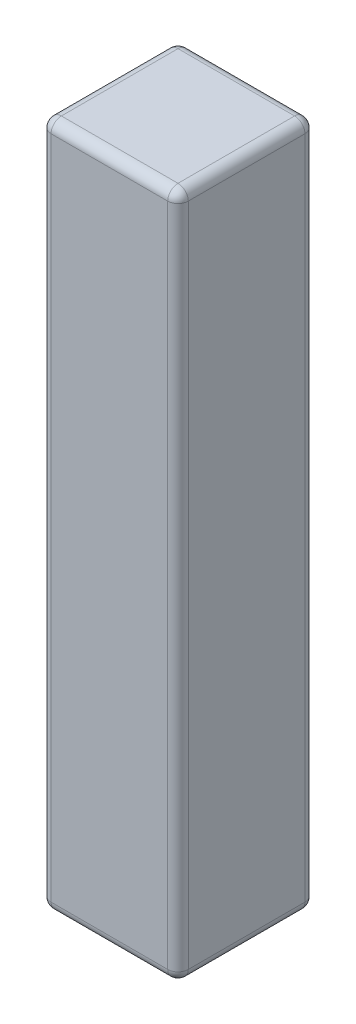
ISO-10303-21;
HEADER;
FILE_DESCRIPTION(('STEP AP214'),'2;1');
FILE_NAME('part.step','',(''),(''),'','','');
FILE_SCHEMA(('AUTOMOTIVE_DESIGN { 1 0 10303 214 1 1 1 1 }'));
ENDSEC;
DATA;
#1=APPLICATION_CONTEXT('core data for automotive mechanical design processes');
#2=APPLICATION_PROTOCOL_DEFINITION('international standard','automotive_design',2000,#1);
#3=PRODUCT_CONTEXT('',#1,'mechanical');
#4=PRODUCT('Part','Part','',(#3));
#5=PRODUCT_RELATED_PRODUCT_CATEGORY('part','',(#4));
#6=PRODUCT_DEFINITION_FORMATION('','',#4);
#7=PRODUCT_DEFINITION_CONTEXT('part definition',#1,'design');
#8=PRODUCT_DEFINITION('design','',#6,#7);
#9=PRODUCT_DEFINITION_SHAPE('','',#8);
#10=(LENGTH_UNIT() NAMED_UNIT(*) SI_UNIT(.MILLI.,.METRE.));
#11=(NAMED_UNIT(*) PLANE_ANGLE_UNIT() SI_UNIT($,.RADIAN.));
#12=(NAMED_UNIT(*) SI_UNIT($,.STERADIAN.) SOLID_ANGLE_UNIT());
#13=UNCERTAINTY_MEASURE_WITH_UNIT(LENGTH_MEASURE(1.E-05),#10,'distance_accuracy_value','');
#14=(GEOMETRIC_REPRESENTATION_CONTEXT(3) GLOBAL_UNCERTAINTY_ASSIGNED_CONTEXT((#13)) GLOBAL_UNIT_ASSIGNED_CONTEXT((#10,
#11,#12)) REPRESENTATION_CONTEXT('',''));
#15=CARTESIAN_POINT('',(0.,0.,0.));
#16=DIRECTION('',(0.,0.,1.));
#17=DIRECTION('',(1.,0.,0.));
#18=AXIS2_PLACEMENT_3D('',#15,#16,#17);
#19=CARTESIAN_POINT('',(-1.00000054,5.,-1.00000054));
#20=DIRECTION('',(1.,0.,0.));
#21=DIRECTION('',(0.,0.,-1.));
#22=AXIS2_PLACEMENT_3D('',#19,#20,#21);
#23=PLANE('',#22);
#24=DIRECTION('',(0.,-1.,0.));
#25=VECTOR('',#24,1.);
#26=CARTESIAN_POINT('',(-1.00000054,5.,0.85000054));
#27=LINE('',#26,#25);
#28=CARTESIAN_POINT('',(-1.00000054,-4.85,0.85000054));
#29=VERTEX_POINT('',#28);
#30=CARTESIAN_POINT('',(-1.00000054,4.85,0.85000054));
#31=VERTEX_POINT('',#30);
#32=EDGE_CURVE('E216',#29,#31,#27,.F.);
#33=ORIENTED_EDGE('',*,*,#32,.T.);
#34=DIRECTION('',(0.,0.,1.));
#35=VECTOR('',#34,1.);
#36=CARTESIAN_POINT('',(-1.00000054,4.85,-1.00000054));
#37=LINE('',#36,#35);
#38=CARTESIAN_POINT('',(-1.00000054,4.85,-0.85000054));
#39=VERTEX_POINT('',#38);
#40=EDGE_CURVE('E219',#31,#39,#37,.F.);
#41=ORIENTED_EDGE('',*,*,#40,.T.);
#42=DIRECTION('',(0.,-1.,0.));
#43=VECTOR('',#42,1.);
#44=CARTESIAN_POINT('',(-1.00000054,5.,-0.85000054));
#45=LINE('',#44,#43);
#46=CARTESIAN_POINT('',(-1.00000054,-4.85,-0.85000054));
#47=VERTEX_POINT('',#46);
#48=EDGE_CURVE('E217',#39,#47,#45,.T.);
#49=ORIENTED_EDGE('',*,*,#48,.T.);
#50=DIRECTION('',(0.,0.,1.));
#51=VECTOR('',#50,1.);
#52=CARTESIAN_POINT('',(-1.00000054,-4.85,-1.00000054));
#53=LINE('',#52,#51);
#54=EDGE_CURVE('E213',#47,#29,#53,.T.);
#55=ORIENTED_EDGE('',*,*,#54,.T.);
#56=EDGE_LOOP('',(#33,#41,#49,#55));
#57=FACE_BOUND('',#56,.T.);
#58=ADVANCED_FACE('F34',(#57),#23,.F.);
#59=CARTESIAN_POINT('',(-1.00000054,5.,1.00000054));
#60=DIRECTION('',(0.,0.,-1.));
#61=DIRECTION('',(-1.,0.,0.));
#62=AXIS2_PLACEMENT_3D('',#59,#60,#61);
#63=PLANE('',#62);
#64=DIRECTION('',(1.,0.,0.));
#65=VECTOR('',#64,1.);
#66=CARTESIAN_POINT('',(-1.00000054,-4.85,1.00000054));
#67=LINE('',#66,#65);
#68=CARTESIAN_POINT('',(-0.85000054,-4.85,1.00000054));
#69=VERTEX_POINT('',#68);
#70=CARTESIAN_POINT('',(0.85000054,-4.85,1.00000054));
#71=VERTEX_POINT('',#70);
#72=EDGE_CURVE('E257',#69,#71,#67,.T.);
#73=ORIENTED_EDGE('',*,*,#72,.T.);
#74=DIRECTION('',(0.,-1.,0.));
#75=VECTOR('',#74,1.);
#76=CARTESIAN_POINT('',(0.85000054,5.,1.00000054));
#77=LINE('',#76,#75);
#78=CARTESIAN_POINT('',(0.85000054,4.85,1.00000054));
#79=VERTEX_POINT('',#78);
#80=EDGE_CURVE('E263',#71,#79,#77,.F.);
#81=ORIENTED_EDGE('',*,*,#80,.T.);
#82=DIRECTION('',(1.,0.,0.));
#83=VECTOR('',#82,1.);
#84=CARTESIAN_POINT('',(-1.00000054,4.85,1.00000054));
#85=LINE('',#84,#83);
#86=CARTESIAN_POINT('',(-0.85000054,4.85,1.00000054));
#87=VERTEX_POINT('',#86);
#88=EDGE_CURVE('E260',#79,#87,#85,.F.);
#89=ORIENTED_EDGE('',*,*,#88,.T.);
#90=DIRECTION('',(0.,-1.,0.));
#91=VECTOR('',#90,1.);
#92=CARTESIAN_POINT('',(-0.85000054,5.,1.00000054));
#93=LINE('',#92,#91);
#94=EDGE_CURVE('E252',#87,#69,#93,.T.);
#95=ORIENTED_EDGE('',*,*,#94,.T.);
#96=EDGE_LOOP('',(#73,#81,#89,#95));
#97=FACE_BOUND('',#96,.T.);
#98=ADVANCED_FACE('F261',(#97),#63,.F.);
#99=CARTESIAN_POINT('',(1.00000054,5.,-1.00000054));
#100=DIRECTION('',(-1.,0.,0.));
#101=DIRECTION('',(0.,0.,1.));
#102=AXIS2_PLACEMENT_3D('',#99,#100,#101);
#103=PLANE('',#102);
#104=DIRECTION('',(0.,0.,-1.));
#105=VECTOR('',#104,1.);
#106=CARTESIAN_POINT('',(1.00000054,4.85,1.00000054));
#107=LINE('',#106,#105);
#108=CARTESIAN_POINT('',(1.00000054,4.85,-0.85000054));
#109=VERTEX_POINT('',#108);
#110=CARTESIAN_POINT('',(1.00000054,4.85,0.85000054));
#111=VERTEX_POINT('',#110);
#112=EDGE_CURVE('E153',#109,#111,#107,.F.);
#113=ORIENTED_EDGE('',*,*,#112,.T.);
#114=DIRECTION('',(0.,-1.,0.));
#115=VECTOR('',#114,1.);
#116=CARTESIAN_POINT('',(1.00000054,5.,0.85000054));
#117=LINE('',#116,#115);
#118=CARTESIAN_POINT('',(1.00000054,-4.85,0.85000054));
#119=VERTEX_POINT('',#118);
#120=EDGE_CURVE('E221',#111,#119,#117,.T.);
#121=ORIENTED_EDGE('',*,*,#120,.T.);
#122=DIRECTION('',(0.,0.,-1.));
#123=VECTOR('',#122,1.);
#124=CARTESIAN_POINT('',(1.00000054,-4.85,-1.00000054));
#125=LINE('',#124,#123);
#126=CARTESIAN_POINT('',(1.00000054,-4.85,-0.85000054));
#127=VERTEX_POINT('',#126);
#128=EDGE_CURVE('E280',#119,#127,#125,.T.);
#129=ORIENTED_EDGE('',*,*,#128,.T.);
#130=DIRECTION('',(0.,-1.,0.));
#131=VECTOR('',#130,1.);
#132=CARTESIAN_POINT('',(1.00000054,5.,-0.85000054));
#133=LINE('',#132,#131);
#134=EDGE_CURVE('E278',#127,#109,#133,.F.);
#135=ORIENTED_EDGE('',*,*,#134,.T.);
#136=EDGE_LOOP('',(#113,#121,#129,#135));
#137=FACE_BOUND('',#136,.T.);
#138=ADVANCED_FACE('F285',(#137),#103,.F.);
#139=CARTESIAN_POINT('',(-1.00000054,5.,-1.00000054));
#140=DIRECTION('',(0.,0.,1.));
#141=DIRECTION('',(1.,0.,0.));
#142=AXIS2_PLACEMENT_3D('',#139,#140,#141);
#143=PLANE('',#142);
#144=DIRECTION('',(-1.,0.,0.));
#145=VECTOR('',#144,1.);
#146=CARTESIAN_POINT('',(1.00000054,4.85,-1.00000054));
#147=LINE('',#146,#145);
#148=CARTESIAN_POINT('',(-0.85000054,4.85,-1.00000054));
#149=VERTEX_POINT('',#148);
#150=CARTESIAN_POINT('',(0.85000054,4.85,-1.00000054));
#151=VERTEX_POINT('',#150);
#152=EDGE_CURVE('E43',#149,#151,#147,.F.);
#153=ORIENTED_EDGE('',*,*,#152,.T.);
#154=DIRECTION('',(0.,-1.,0.));
#155=VECTOR('',#154,1.);
#156=CARTESIAN_POINT('',(0.85000054,5.,-1.00000054));
#157=LINE('',#156,#155);
#158=CARTESIAN_POINT('',(0.85000054,-4.85,-1.00000054));
#159=VERTEX_POINT('',#158);
#160=EDGE_CURVE('E11',#151,#159,#157,.T.);
#161=ORIENTED_EDGE('',*,*,#160,.T.);
#162=DIRECTION('',(-1.,0.,0.));
#163=VECTOR('',#162,1.);
#164=CARTESIAN_POINT('',(-1.00000054,-4.85,-1.00000054));
#165=LINE('',#164,#163);
#166=CARTESIAN_POINT('',(-0.85000054,-4.85,-1.00000054));
#167=VERTEX_POINT('',#166);
#168=EDGE_CURVE('E227',#159,#167,#165,.T.);
#169=ORIENTED_EDGE('',*,*,#168,.T.);
#170=DIRECTION('',(0.,-1.,0.));
#171=VECTOR('',#170,1.);
#172=CARTESIAN_POINT('',(-0.85000054,5.,-1.00000054));
#173=LINE('',#172,#171);
#174=EDGE_CURVE('E54',#167,#149,#173,.F.);
#175=ORIENTED_EDGE('',*,*,#174,.T.);
#176=EDGE_LOOP('',(#153,#161,#169,#175));
#177=FACE_BOUND('',#176,.T.);
#178=ADVANCED_FACE('F356',(#177),#143,.F.);
#179=CARTESIAN_POINT('',(-1.00000054,5.,1.00000054));
#180=DIRECTION('',(0.,1.,0.));
#181=DIRECTION('',(0.,0.,1.));
#182=AXIS2_PLACEMENT_3D('',#179,#180,#181);
#183=PLANE('',#182);
#184=DIRECTION('',(0.,0.,1.));
#185=VECTOR('',#184,1.);
#186=CARTESIAN_POINT('',(-0.85000054,5.,1.00000054));
#187=LINE('',#186,#185);
#188=CARTESIAN_POINT('',(-0.85000054,5.,-0.85000054));
#189=VERTEX_POINT('',#188);
#190=CARTESIAN_POINT('',(-0.85000054,5.,0.85000054));
#191=VERTEX_POINT('',#190);
#192=EDGE_CURVE('E132',#189,#191,#187,.T.);
#193=ORIENTED_EDGE('',*,*,#192,.T.);
#194=DIRECTION('',(1.,0.,0.));
#195=VECTOR('',#194,1.);
#196=CARTESIAN_POINT('',(1.00000054,5.,0.85000054));
#197=LINE('',#196,#195);
#198=CARTESIAN_POINT('',(0.85000054,5.,0.85000054));
#199=VERTEX_POINT('',#198);
#200=EDGE_CURVE('E128',#191,#199,#197,.T.);
#201=ORIENTED_EDGE('',*,*,#200,.T.);
#202=DIRECTION('',(0.,0.,-1.));
#203=VECTOR('',#202,1.);
#204=CARTESIAN_POINT('',(0.85000054,5.,-1.00000054));
#205=LINE('',#204,#203);
#206=CARTESIAN_POINT('',(0.85000054,5.,-0.85000054));
#207=VERTEX_POINT('',#206);
#208=EDGE_CURVE('E122',#199,#207,#205,.T.);
#209=ORIENTED_EDGE('',*,*,#208,.T.);
#210=DIRECTION('',(-1.,0.,0.));
#211=VECTOR('',#210,1.);
#212=CARTESIAN_POINT('',(-1.00000054,5.,-0.85000054));
#213=LINE('',#212,#211);
#214=EDGE_CURVE('E125',#207,#189,#213,.T.);
#215=ORIENTED_EDGE('',*,*,#214,.T.);
#216=EDGE_LOOP('',(#193,#201,#209,#215));
#217=FACE_BOUND('',#216,.T.);
#218=ADVANCED_FACE('F124',(#217),#183,.T.);
#219=CARTESIAN_POINT('',(-1.00000054,-5.,1.00000054));
#220=DIRECTION('',(0.,1.,0.));
#221=DIRECTION('',(0.,0.,1.));
#222=AXIS2_PLACEMENT_3D('',#219,#220,#221);
#223=PLANE('',#222);
#224=DIRECTION('',(0.,0.,-1.));
#225=VECTOR('',#224,1.);
#226=CARTESIAN_POINT('',(0.85000054,-5.,1.00000054));
#227=LINE('',#226,#225);
#228=CARTESIAN_POINT('',(0.85000054,-5.,-0.85000054));
#229=VERTEX_POINT('',#228);
#230=CARTESIAN_POINT('',(0.85000054,-5.,0.85000054));
#231=VERTEX_POINT('',#230);
#232=EDGE_CURVE('E274',#229,#231,#227,.F.);
#233=ORIENTED_EDGE('',*,*,#232,.T.);
#234=DIRECTION('',(1.,0.,0.));
#235=VECTOR('',#234,1.);
#236=CARTESIAN_POINT('',(-1.00000054,-5.,0.85000054));
#237=LINE('',#236,#235);
#238=CARTESIAN_POINT('',(-0.85000054,-5.,0.85000054));
#239=VERTEX_POINT('',#238);
#240=EDGE_CURVE('E276',#231,#239,#237,.F.);
#241=ORIENTED_EDGE('',*,*,#240,.T.);
#242=DIRECTION('',(0.,0.,1.));
#243=VECTOR('',#242,1.);
#244=CARTESIAN_POINT('',(-0.85000054,-5.,1.00000054));
#245=LINE('',#244,#243);
#246=CARTESIAN_POINT('',(-0.85000054,-5.,-0.85000054));
#247=VERTEX_POINT('',#246);
#248=EDGE_CURVE('E211',#239,#247,#245,.F.);
#249=ORIENTED_EDGE('',*,*,#248,.T.);
#250=DIRECTION('',(-1.,0.,0.));
#251=VECTOR('',#250,1.);
#252=CARTESIAN_POINT('',(-1.00000054,-5.,-0.85000054));
#253=LINE('',#252,#251);
#254=EDGE_CURVE('E268',#247,#229,#253,.F.);
#255=ORIENTED_EDGE('',*,*,#254,.T.);
#256=EDGE_LOOP('',(#233,#241,#249,#255));
#257=FACE_BOUND('',#256,.T.);
#258=ADVANCED_FACE('F357',(#257),#223,.F.);
#259=CARTESIAN_POINT('',(-1.00000054,-4.85,-0.85000054));
#260=DIRECTION('',(-1.,0.,0.));
#261=DIRECTION('',(0.,0.,1.));
#262=AXIS2_PLACEMENT_3D('',#259,#260,#261);
#263=CYLINDRICAL_SURFACE('',#262,0.15);
#264=CARTESIAN_POINT('',(-0.85000054,-4.85,-0.85000054));
#265=DIRECTION('',(-1.,0.,0.));
#266=DIRECTION('',(0.,0.,1.));
#267=AXIS2_PLACEMENT_3D('',#264,#265,#266);
#268=CIRCLE('',#267,0.15);
#269=EDGE_CURVE('E38',#167,#247,#268,.T.);
#270=ORIENTED_EDGE('',*,*,#269,.F.);
#271=ORIENTED_EDGE('',*,*,#168,.F.);
#272=CARTESIAN_POINT('',(0.85000054,-4.85,-0.85000054));
#273=DIRECTION('',(1.,0.,0.));
#274=DIRECTION('',(0.,0.,-1.));
#275=AXIS2_PLACEMENT_3D('',#272,#273,#274);
#276=CIRCLE('',#275,0.15);
#277=EDGE_CURVE('E191',#229,#159,#276,.T.);
#278=ORIENTED_EDGE('',*,*,#277,.F.);
#279=ORIENTED_EDGE('',*,*,#254,.F.);
#280=EDGE_LOOP('',(#270,#271,#278,#279));
#281=FACE_BOUND('',#280,.T.);
#282=ADVANCED_FACE('F36',(#281),#263,.T.);
#283=CARTESIAN_POINT('',(-0.85000054,-4.85,-0.85000054));
#284=DIRECTION('',(0.,0.,1.));
#285=DIRECTION('',(1.,0.,0.));
#286=AXIS2_PLACEMENT_3D('',#283,#284,#285);
#287=SPHERICAL_SURFACE('',#286,0.15);
#288=CARTESIAN_POINT('',(-0.85000054,-4.85,-0.85000054));
#289=DIRECTION('',(0.,-1.,0.));
#290=DIRECTION('',(0.,0.,-1.));
#291=AXIS2_PLACEMENT_3D('',#288,#289,#290);
#292=CIRCLE('',#291,0.15);
#293=EDGE_CURVE('E186',#167,#47,#292,.F.);
#294=ORIENTED_EDGE('',*,*,#293,.F.);
#295=ORIENTED_EDGE('',*,*,#269,.T.);
#296=CARTESIAN_POINT('',(-0.85000054,-4.85,-0.85000054));
#297=DIRECTION('',(0.,0.,-1.));
#298=DIRECTION('',(-1.,0.,0.));
#299=AXIS2_PLACEMENT_3D('',#296,#297,#298);
#300=CIRCLE('',#299,0.15);
#301=EDGE_CURVE('E189',#47,#247,#300,.F.);
#302=ORIENTED_EDGE('',*,*,#301,.F.);
#303=EDGE_LOOP('',(#294,#295,#302));
#304=FACE_BOUND('',#303,.T.);
#305=ADVANCED_FACE('F203',(#304),#287,.T.);
#306=CARTESIAN_POINT('',(0.85000054,-4.85,-0.85000054));
#307=DIRECTION('',(0.,0.,1.));
#308=DIRECTION('',(1.,0.,0.));
#309=AXIS2_PLACEMENT_3D('',#306,#307,#308);
#310=SPHERICAL_SURFACE('',#309,0.15);
#311=CARTESIAN_POINT('',(0.85000054,-4.85,-0.85000054));
#312=DIRECTION('',(0.,0.,-1.));
#313=DIRECTION('',(-1.,0.,0.));
#314=AXIS2_PLACEMENT_3D('',#311,#312,#313);
#315=CIRCLE('',#314,0.15);
#316=EDGE_CURVE('E181',#229,#127,#315,.F.);
#317=ORIENTED_EDGE('',*,*,#316,.F.);
#318=ORIENTED_EDGE('',*,*,#277,.T.);
#319=CARTESIAN_POINT('',(0.85000054,-4.85,-0.85000054));
#320=DIRECTION('',(0.,-1.,0.));
#321=DIRECTION('',(0.,0.,-1.));
#322=AXIS2_PLACEMENT_3D('',#319,#320,#321);
#323=CIRCLE('',#322,0.15);
#324=EDGE_CURVE('E184',#127,#159,#323,.F.);
#325=ORIENTED_EDGE('',*,*,#324,.F.);
#326=EDGE_LOOP('',(#317,#318,#325));
#327=FACE_BOUND('',#326,.T.);
#328=ADVANCED_FACE('F353',(#327),#310,.T.);
#329=CARTESIAN_POINT('',(-0.85000054,-4.85,-1.00000054));
#330=DIRECTION('',(0.,0.,1.));
#331=DIRECTION('',(1.,0.,0.));
#332=AXIS2_PLACEMENT_3D('',#329,#330,#331);
#333=CYLINDRICAL_SURFACE('',#332,0.15);
#334=ORIENTED_EDGE('',*,*,#301,.T.);
#335=ORIENTED_EDGE('',*,*,#248,.F.);
#336=CARTESIAN_POINT('',(-0.85000054,-4.85,0.85000054));
#337=DIRECTION('',(0.,0.,1.));
#338=DIRECTION('',(1.,0.,0.));
#339=AXIS2_PLACEMENT_3D('',#336,#337,#338);
#340=CIRCLE('',#339,0.15);
#341=EDGE_CURVE('E176',#29,#239,#340,.T.);
#342=ORIENTED_EDGE('',*,*,#341,.F.);
#343=ORIENTED_EDGE('',*,*,#54,.F.);
#344=EDGE_LOOP('',(#334,#335,#342,#343));
#345=FACE_BOUND('',#344,.T.);
#346=ADVANCED_FACE('F209',(#345),#333,.T.);
#347=CARTESIAN_POINT('',(-0.85000054,5.,-0.85000054));
#348=DIRECTION('',(0.,-1.,0.));
#349=DIRECTION('',(0.,0.,-1.));
#350=AXIS2_PLACEMENT_3D('',#347,#348,#349);
#351=CYLINDRICAL_SURFACE('',#350,0.15);
#352=ORIENTED_EDGE('',*,*,#293,.T.);
#353=ORIENTED_EDGE('',*,*,#48,.F.);
#354=CARTESIAN_POINT('',(-0.85000054,4.85,-0.85000054));
#355=DIRECTION('',(0.,1.,0.));
#356=DIRECTION('',(0.,0.,1.));
#357=AXIS2_PLACEMENT_3D('',#354,#355,#356);
#358=CIRCLE('',#357,0.15);
#359=EDGE_CURVE('E173',#149,#39,#358,.T.);
#360=ORIENTED_EDGE('',*,*,#359,.F.);
#361=ORIENTED_EDGE('',*,*,#174,.F.);
#362=EDGE_LOOP('',(#352,#353,#360,#361));
#363=FACE_BOUND('',#362,.T.);
#364=ADVANCED_FACE('F302',(#363),#351,.T.);
#365=CARTESIAN_POINT('',(-1.00000054,4.85,-0.85000054));
#366=DIRECTION('',(1.,0.,0.));
#367=DIRECTION('',(0.,0.,-1.));
#368=AXIS2_PLACEMENT_3D('',#365,#366,#367);
#369=CYLINDRICAL_SURFACE('',#368,0.15);
#370=CARTESIAN_POINT('',(0.85000054,4.85,-0.85000054));
#371=DIRECTION('',(1.,0.,0.));
#372=DIRECTION('',(0.,0.,-1.));
#373=AXIS2_PLACEMENT_3D('',#370,#371,#372);
#374=CIRCLE('',#373,0.15);
#375=EDGE_CURVE('E138',#151,#207,#374,.T.);
#376=ORIENTED_EDGE('',*,*,#375,.F.);
#377=ORIENTED_EDGE('',*,*,#152,.F.);
#378=CARTESIAN_POINT('',(-0.85000054,4.85,-0.85000054));
#379=DIRECTION('',(-1.,0.,0.));
#380=DIRECTION('',(0.,0.,1.));
#381=AXIS2_PLACEMENT_3D('',#378,#379,#380);
#382=CIRCLE('',#381,0.15);
#383=EDGE_CURVE('E141',#189,#149,#382,.T.);
#384=ORIENTED_EDGE('',*,*,#383,.F.);
#385=ORIENTED_EDGE('',*,*,#214,.F.);
#386=EDGE_LOOP('',(#376,#377,#384,#385));
#387=FACE_BOUND('',#386,.T.);
#388=ADVANCED_FACE('F137',(#387),#369,.T.);
#389=CARTESIAN_POINT('',(0.85000054,5.,-0.85000054));
#390=DIRECTION('',(0.,-1.,0.));
#391=DIRECTION('',(0.,0.,-1.));
#392=AXIS2_PLACEMENT_3D('',#389,#390,#391);
#393=CYLINDRICAL_SURFACE('',#392,0.15);
#394=ORIENTED_EDGE('',*,*,#324,.T.);
#395=ORIENTED_EDGE('',*,*,#160,.F.);
#396=CARTESIAN_POINT('',(0.85000054,4.85,-0.85000054));
#397=DIRECTION('',(0.,1.,0.));
#398=DIRECTION('',(0.,0.,1.));
#399=AXIS2_PLACEMENT_3D('',#396,#397,#398);
#400=CIRCLE('',#399,0.15);
#401=EDGE_CURVE('E150',#109,#151,#400,.T.);
#402=ORIENTED_EDGE('',*,*,#401,.F.);
#403=ORIENTED_EDGE('',*,*,#134,.F.);
#404=EDGE_LOOP('',(#394,#395,#402,#403));
#405=FACE_BOUND('',#404,.T.);
#406=ADVANCED_FACE('F355',(#405),#393,.T.);
#407=CARTESIAN_POINT('',(0.85000054,-4.85,-1.00000054));
#408=DIRECTION('',(0.,0.,-1.));
#409=DIRECTION('',(-1.,0.,0.));
#410=AXIS2_PLACEMENT_3D('',#407,#408,#409);
#411=CYLINDRICAL_SURFACE('',#410,0.15);
#412=ORIENTED_EDGE('',*,*,#316,.T.);
#413=ORIENTED_EDGE('',*,*,#128,.F.);
#414=CARTESIAN_POINT('',(0.85000054,-4.85,0.85000054));
#415=DIRECTION('',(0.,0.,1.));
#416=DIRECTION('',(1.,0.,0.));
#417=AXIS2_PLACEMENT_3D('',#414,#415,#416);
#418=CIRCLE('',#417,0.15);
#419=EDGE_CURVE('E168',#231,#119,#418,.T.);
#420=ORIENTED_EDGE('',*,*,#419,.F.);
#421=ORIENTED_EDGE('',*,*,#232,.F.);
#422=EDGE_LOOP('',(#412,#413,#420,#421));
#423=FACE_BOUND('',#422,.T.);
#424=ADVANCED_FACE('F351',(#423),#411,.T.);
#425=CARTESIAN_POINT('',(-1.00000054,-4.85,0.85000054));
#426=DIRECTION('',(1.,0.,0.));
#427=DIRECTION('',(0.,0.,-1.));
#428=AXIS2_PLACEMENT_3D('',#425,#426,#427);
#429=CYLINDRICAL_SURFACE('',#428,0.15);
#430=CARTESIAN_POINT('',(-0.85000054,-4.85,0.85000054));
#431=DIRECTION('',(-1.,0.,0.));
#432=DIRECTION('',(0.,0.,1.));
#433=AXIS2_PLACEMENT_3D('',#430,#431,#432);
#434=CIRCLE('',#433,0.15);
#435=EDGE_CURVE('E178',#239,#69,#434,.T.);
#436=ORIENTED_EDGE('',*,*,#435,.F.);
#437=ORIENTED_EDGE('',*,*,#240,.F.);
#438=CARTESIAN_POINT('',(0.85000054,-4.85,0.85000054));
#439=DIRECTION('',(1.,0.,0.));
#440=DIRECTION('',(0.,0.,-1.));
#441=AXIS2_PLACEMENT_3D('',#438,#439,#440);
#442=CIRCLE('',#441,0.15);
#443=EDGE_CURVE('E165',#71,#231,#442,.T.);
#444=ORIENTED_EDGE('',*,*,#443,.F.);
#445=ORIENTED_EDGE('',*,*,#72,.F.);
#446=EDGE_LOOP('',(#436,#437,#444,#445));
#447=FACE_BOUND('',#446,.T.);
#448=ADVANCED_FACE('F314',(#447),#429,.T.);
#449=CARTESIAN_POINT('',(-0.85000054,-4.85,0.85000054));
#450=DIRECTION('',(0.,0.,1.));
#451=DIRECTION('',(1.,0.,0.));
#452=AXIS2_PLACEMENT_3D('',#449,#450,#451);
#453=SPHERICAL_SURFACE('',#452,0.15);
#454=ORIENTED_EDGE('',*,*,#341,.T.);
#455=ORIENTED_EDGE('',*,*,#435,.T.);
#456=CARTESIAN_POINT('',(-0.85000054,-4.85,0.85000054));
#457=DIRECTION('',(0.,-1.,0.));
#458=DIRECTION('',(0.,0.,-1.));
#459=AXIS2_PLACEMENT_3D('',#456,#457,#458);
#460=CIRCLE('',#459,0.15);
#461=EDGE_CURVE('E157',#29,#69,#460,.F.);
#462=ORIENTED_EDGE('',*,*,#461,.F.);
#463=EDGE_LOOP('',(#454,#455,#462));
#464=FACE_BOUND('',#463,.T.);
#465=ADVANCED_FACE('F306',(#464),#453,.T.);
#466=CARTESIAN_POINT('',(-0.85000054,4.85,-0.85000054));
#467=DIRECTION('',(0.,0.,1.));
#468=DIRECTION('',(1.,0.,0.));
#469=AXIS2_PLACEMENT_3D('',#466,#467,#468);
#470=SPHERICAL_SURFACE('',#469,0.15);
#471=ORIENTED_EDGE('',*,*,#383,.T.);
#472=ORIENTED_EDGE('',*,*,#359,.T.);
#473=CARTESIAN_POINT('',(-0.85000054,4.85,-0.85000054));
#474=DIRECTION('',(0.,0.,-1.));
#475=DIRECTION('',(-1.,0.,0.));
#476=AXIS2_PLACEMENT_3D('',#473,#474,#475);
#477=CIRCLE('',#476,0.15);
#478=EDGE_CURVE('E154',#189,#39,#477,.F.);
#479=ORIENTED_EDGE('',*,*,#478,.F.);
#480=EDGE_LOOP('',(#471,#472,#479));
#481=FACE_BOUND('',#480,.T.);
#482=ADVANCED_FACE('F304',(#481),#470,.T.);
#483=CARTESIAN_POINT('',(0.85000054,4.85,-0.85000054));
#484=DIRECTION('',(0.,0.,1.));
#485=DIRECTION('',(1.,0.,0.));
#486=AXIS2_PLACEMENT_3D('',#483,#484,#485);
#487=SPHERICAL_SURFACE('',#486,0.15);
#488=ORIENTED_EDGE('',*,*,#401,.T.);
#489=ORIENTED_EDGE('',*,*,#375,.T.);
#490=CARTESIAN_POINT('',(0.85000054,4.85,-0.85000054));
#491=DIRECTION('',(0.,0.,-1.));
#492=DIRECTION('',(-1.,0.,0.));
#493=AXIS2_PLACEMENT_3D('',#490,#491,#492);
#494=CIRCLE('',#493,0.15);
#495=EDGE_CURVE('E147',#109,#207,#494,.F.);
#496=ORIENTED_EDGE('',*,*,#495,.F.);
#497=EDGE_LOOP('',(#488,#489,#496));
#498=FACE_BOUND('',#497,.T.);
#499=ADVANCED_FACE('F146',(#498),#487,.T.);
#500=CARTESIAN_POINT('',(0.85000054,-4.85,0.85000054));
#501=DIRECTION('',(0.,0.,1.));
#502=DIRECTION('',(1.,0.,0.));
#503=AXIS2_PLACEMENT_3D('',#500,#501,#502);
#504=SPHERICAL_SURFACE('',#503,0.15);
#505=ORIENTED_EDGE('',*,*,#443,.T.);
#506=ORIENTED_EDGE('',*,*,#419,.T.);
#507=CARTESIAN_POINT('',(0.85000054,-4.85,0.85000054));
#508=DIRECTION('',(0.,-1.,0.));
#509=DIRECTION('',(0.,0.,-1.));
#510=AXIS2_PLACEMENT_3D('',#507,#508,#509);
#511=CIRCLE('',#510,0.15);
#512=EDGE_CURVE('E155',#71,#119,#511,.F.);
#513=ORIENTED_EDGE('',*,*,#512,.F.);
#514=EDGE_LOOP('',(#505,#506,#513));
#515=FACE_BOUND('',#514,.T.);
#516=ADVANCED_FACE('F312',(#515),#504,.T.);
#517=CARTESIAN_POINT('',(-0.85000054,5.,0.85000054));
#518=DIRECTION('',(0.,-1.,0.));
#519=DIRECTION('',(0.,0.,-1.));
#520=AXIS2_PLACEMENT_3D('',#517,#518,#519);
#521=CYLINDRICAL_SURFACE('',#520,0.15);
#522=ORIENTED_EDGE('',*,*,#461,.T.);
#523=ORIENTED_EDGE('',*,*,#94,.F.);
#524=CARTESIAN_POINT('',(-0.85000054,4.85,0.85000054));
#525=DIRECTION('',(0.,1.,0.));
#526=DIRECTION('',(0.,0.,1.));
#527=AXIS2_PLACEMENT_3D('',#524,#525,#526);
#528=CIRCLE('',#527,0.15);
#529=EDGE_CURVE('E159',#31,#87,#528,.T.);
#530=ORIENTED_EDGE('',*,*,#529,.F.);
#531=ORIENTED_EDGE('',*,*,#32,.F.);
#532=EDGE_LOOP('',(#522,#523,#530,#531));
#533=FACE_BOUND('',#532,.T.);
#534=ADVANCED_FACE('F254',(#533),#521,.T.);
#535=CARTESIAN_POINT('',(-0.85000054,4.85,1.00000054));
#536=DIRECTION('',(0.,0.,-1.));
#537=DIRECTION('',(-1.,0.,0.));
#538=AXIS2_PLACEMENT_3D('',#535,#536,#537);
#539=CYLINDRICAL_SURFACE('',#538,0.15);
#540=ORIENTED_EDGE('',*,*,#478,.T.);
#541=ORIENTED_EDGE('',*,*,#40,.F.);
#542=CARTESIAN_POINT('',(-0.85000054,4.85,0.85000054));
#543=DIRECTION('',(0.,0.,1.));
#544=DIRECTION('',(1.,0.,0.));
#545=AXIS2_PLACEMENT_3D('',#542,#543,#544);
#546=CIRCLE('',#545,0.15);
#547=EDGE_CURVE('E241',#191,#31,#546,.T.);
#548=ORIENTED_EDGE('',*,*,#547,.F.);
#549=ORIENTED_EDGE('',*,*,#192,.F.);
#550=EDGE_LOOP('',(#540,#541,#548,#549));
#551=FACE_BOUND('',#550,.T.);
#552=ADVANCED_FACE('F298',(#551),#539,.T.);
#553=CARTESIAN_POINT('',(0.85000054,4.85,1.00000054));
#554=DIRECTION('',(0.,0.,1.));
#555=DIRECTION('',(1.,0.,0.));
#556=AXIS2_PLACEMENT_3D('',#553,#554,#555);
#557=CYLINDRICAL_SURFACE('',#556,0.15);
#558=ORIENTED_EDGE('',*,*,#495,.T.);
#559=ORIENTED_EDGE('',*,*,#208,.F.);
#560=CARTESIAN_POINT('',(0.85000054,4.85,0.85000054));
#561=DIRECTION('',(0.,0.,1.));
#562=DIRECTION('',(1.,0.,0.));
#563=AXIS2_PLACEMENT_3D('',#560,#561,#562);
#564=CIRCLE('',#563,0.15);
#565=EDGE_CURVE('E238',#111,#199,#564,.T.);
#566=ORIENTED_EDGE('',*,*,#565,.F.);
#567=ORIENTED_EDGE('',*,*,#112,.F.);
#568=EDGE_LOOP('',(#558,#559,#566,#567));
#569=FACE_BOUND('',#568,.T.);
#570=ADVANCED_FACE('F152',(#569),#557,.T.);
#571=CARTESIAN_POINT('',(0.85000054,5.,0.85000054));
#572=DIRECTION('',(0.,-1.,0.));
#573=DIRECTION('',(0.,0.,-1.));
#574=AXIS2_PLACEMENT_3D('',#571,#572,#573);
#575=CYLINDRICAL_SURFACE('',#574,0.15);
#576=ORIENTED_EDGE('',*,*,#512,.T.);
#577=ORIENTED_EDGE('',*,*,#120,.F.);
#578=CARTESIAN_POINT('',(0.85000054,4.85,0.85000054));
#579=DIRECTION('',(0.,1.,0.));
#580=DIRECTION('',(0.,0.,1.));
#581=AXIS2_PLACEMENT_3D('',#578,#579,#580);
#582=CIRCLE('',#581,0.15);
#583=EDGE_CURVE('E235',#79,#111,#582,.T.);
#584=ORIENTED_EDGE('',*,*,#583,.F.);
#585=ORIENTED_EDGE('',*,*,#80,.F.);
#586=EDGE_LOOP('',(#576,#577,#584,#585));
#587=FACE_BOUND('',#586,.T.);
#588=ADVANCED_FACE('F288',(#587),#575,.T.);
#589=CARTESIAN_POINT('',(-0.85000054,4.85,0.85000054));
#590=DIRECTION('',(0.,0.,1.));
#591=DIRECTION('',(1.,0.,0.));
#592=AXIS2_PLACEMENT_3D('',#589,#590,#591);
#593=SPHERICAL_SURFACE('',#592,0.15);
#594=ORIENTED_EDGE('',*,*,#547,.T.);
#595=ORIENTED_EDGE('',*,*,#529,.T.);
#596=CARTESIAN_POINT('',(-0.85000054,4.85,0.85000054));
#597=DIRECTION('',(-1.,0.,0.));
#598=DIRECTION('',(0.,0.,1.));
#599=AXIS2_PLACEMENT_3D('',#596,#597,#598);
#600=CIRCLE('',#599,0.15);
#601=EDGE_CURVE('E233',#191,#87,#600,.F.);
#602=ORIENTED_EDGE('',*,*,#601,.F.);
#603=EDGE_LOOP('',(#594,#595,#602));
#604=FACE_BOUND('',#603,.T.);
#605=ADVANCED_FACE('F248',(#604),#593,.T.);
#606=CARTESIAN_POINT('',(0.85000054,4.85,0.85000054));
#607=DIRECTION('',(0.,0.,1.));
#608=DIRECTION('',(1.,0.,0.));
#609=AXIS2_PLACEMENT_3D('',#606,#607,#608);
#610=SPHERICAL_SURFACE('',#609,0.15);
#611=ORIENTED_EDGE('',*,*,#583,.T.);
#612=ORIENTED_EDGE('',*,*,#565,.T.);
#613=CARTESIAN_POINT('',(0.85000054,4.85,0.85000054));
#614=DIRECTION('',(1.,0.,0.));
#615=DIRECTION('',(0.,0.,-1.));
#616=AXIS2_PLACEMENT_3D('',#613,#614,#615);
#617=CIRCLE('',#616,0.15);
#618=EDGE_CURVE('E231',#79,#199,#617,.F.);
#619=ORIENTED_EDGE('',*,*,#618,.F.);
#620=EDGE_LOOP('',(#611,#612,#619));
#621=FACE_BOUND('',#620,.T.);
#622=ADVANCED_FACE('F291',(#621),#610,.T.);
#623=CARTESIAN_POINT('',(-1.00000054,4.85,0.85000054));
#624=DIRECTION('',(-1.,0.,0.));
#625=DIRECTION('',(0.,0.,1.));
#626=AXIS2_PLACEMENT_3D('',#623,#624,#625);
#627=CYLINDRICAL_SURFACE('',#626,0.15);
#628=ORIENTED_EDGE('',*,*,#601,.T.);
#629=ORIENTED_EDGE('',*,*,#88,.F.);
#630=ORIENTED_EDGE('',*,*,#618,.T.);
#631=ORIENTED_EDGE('',*,*,#200,.F.);
#632=EDGE_LOOP('',(#628,#629,#630,#631));
#633=FACE_BOUND('',#632,.T.);
#634=ADVANCED_FACE('F292',(#633),#627,.T.);
#635=CLOSED_SHELL('',(#58,#98,#138,#178,#218,#258,#282,#305,#328,#346,#364,#388,#406,#424,#448,
#465,#482,#499,#516,#534,#552,#570,#588,#605,#622,#634));
#636=MANIFOLD_SOLID_BREP('B2',#635);
#637=ADVANCED_BREP_SHAPE_REPRESENTATION('',(#18,#636),#14);
#638=SHAPE_DEFINITION_REPRESENTATION(#9,#637);
ENDSEC;
END-ISO-10303-21;
